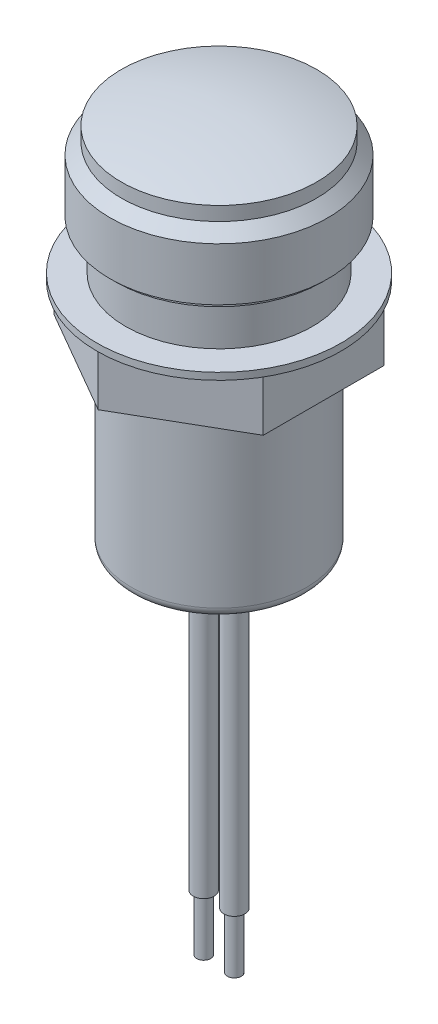
ISO-10303-21;
HEADER;
FILE_DESCRIPTION(('STEP AP214'),'2;1');
FILE_NAME('part.step','',(''),(''),'','','');
FILE_SCHEMA(('AUTOMOTIVE_DESIGN { 1 0 10303 214 1 1 1 1 }'));
ENDSEC;
DATA;
#1=APPLICATION_CONTEXT('core data for automotive mechanical design processes');
#2=APPLICATION_PROTOCOL_DEFINITION('international standard','automotive_design',2000,#1);
#3=PRODUCT_CONTEXT('',#1,'mechanical');
#4=PRODUCT('Part','Part','',(#3));
#5=PRODUCT_RELATED_PRODUCT_CATEGORY('part','',(#4));
#6=PRODUCT_DEFINITION_FORMATION('','',#4);
#7=PRODUCT_DEFINITION_CONTEXT('part definition',#1,'design');
#8=PRODUCT_DEFINITION('design','',#6,#7);
#9=PRODUCT_DEFINITION_SHAPE('','',#8);
#10=(LENGTH_UNIT() NAMED_UNIT(*) SI_UNIT(.MILLI.,.METRE.));
#11=(NAMED_UNIT(*) PLANE_ANGLE_UNIT() SI_UNIT($,.RADIAN.));
#12=(NAMED_UNIT(*) SI_UNIT($,.STERADIAN.) SOLID_ANGLE_UNIT());
#13=UNCERTAINTY_MEASURE_WITH_UNIT(LENGTH_MEASURE(1.E-05),#10,'distance_accuracy_value','');
#14=(GEOMETRIC_REPRESENTATION_CONTEXT(3) GLOBAL_UNCERTAINTY_ASSIGNED_CONTEXT((#13)) GLOBAL_UNIT_ASSIGNED_CONTEXT((#10,
#11,#12)) REPRESENTATION_CONTEXT('',''));
#15=CARTESIAN_POINT('',(0.,0.,0.));
#16=DIRECTION('',(0.,0.,1.));
#17=DIRECTION('',(1.,0.,0.));
#18=AXIS2_PLACEMENT_3D('',#15,#16,#17);
#19=CARTESIAN_POINT('',(0.,5.08000000000001,0.));
#20=DIRECTION('',(0.,0.,1.));
#21=DIRECTION('',(1.,0.,0.));
#22=AXIS2_PLACEMENT_3D('',#19,#20,#21);
#23=SPHERICAL_SURFACE('',#22,31.75);
#24=CARTESIAN_POINT('',(0.,5.08000000000001,0.));
#25=DIRECTION('',(0.,-1.,0.));
#26=DIRECTION('',(0.,0.,-1.));
#27=AXIS2_PLACEMENT_3D('',#24,#25,#26);
#28=SPHERICAL_SURFACE('',#27,31.75);
#29=CARTESIAN_POINT('',(0.,35.56,0.));
#30=DIRECTION('',(0.,-1.,0.));
#31=DIRECTION('',(0.,0.,-1.));
#32=AXIS2_PLACEMENT_3D('',#29,#30,#31);
#33=CIRCLE('',#32,8.89);
#34=CARTESIAN_POINT('',(0.,35.56,-8.89));
#35=VERTEX_POINT('',#34);
#36=EDGE_CURVE('E195',#35,#35,#33,.T.);
#37=ORIENTED_EDGE('',*,*,#36,.F.);
#38=EDGE_LOOP('',(#37));
#39=FACE_BOUND('',#38,.T.);
#40=ADVANCED_FACE('F46',(#39),#28,.T.);
#41=CARTESIAN_POINT('',(0.,0.,0.));
#42=DIRECTION('',(0.,-1.,0.));
#43=DIRECTION('',(0.,0.,-1.));
#44=AXIS2_PLACEMENT_3D('',#41,#42,#43);
#45=CYLINDRICAL_SURFACE('',#44,8.89);
#46=ORIENTED_EDGE('',*,*,#36,.T.);
#47=EDGE_LOOP('',(#46));
#48=FACE_BOUND('',#47,.T.);
#49=CARTESIAN_POINT('',(0.,34.29,0.));
#50=DIRECTION('',(0.,-1.,0.));
#51=DIRECTION('',(0.,0.,-1.));
#52=AXIS2_PLACEMENT_3D('',#49,#50,#51);
#53=CIRCLE('',#52,8.89);
#54=CARTESIAN_POINT('',(0.,34.29,-8.89));
#55=VERTEX_POINT('',#54);
#56=EDGE_CURVE('E191',#55,#55,#53,.T.);
#57=ORIENTED_EDGE('',*,*,#56,.F.);
#58=EDGE_LOOP('',(#57));
#59=FACE_BOUND('',#58,.T.);
#60=ADVANCED_FACE('F313',(#48,#59),#45,.T.);
#61=CARTESIAN_POINT('',(0.,33.2613,0.));
#62=DIRECTION('',(0.,-1.,0.));
#63=DIRECTION('',(0.,0.,-1.));
#64=AXIS2_PLACEMENT_3D('',#61,#62,#63);
#65=CONICAL_SURFACE('',#64,9.9187,0.785398163397449);
#66=ORIENTED_EDGE('',*,*,#56,.T.);
#67=EDGE_LOOP('',(#66));
#68=FACE_BOUND('',#67,.T.);
#69=CARTESIAN_POINT('',(0.,33.2613,0.));
#70=DIRECTION('',(0.,-1.,0.));
#71=DIRECTION('',(0.,0.,-1.));
#72=AXIS2_PLACEMENT_3D('',#69,#70,#71);
#73=CIRCLE('',#72,9.9187);
#74=CARTESIAN_POINT('',(0.,33.2613,-9.9187));
#75=VERTEX_POINT('',#74);
#76=EDGE_CURVE('E187',#75,#75,#73,.T.);
#77=ORIENTED_EDGE('',*,*,#76,.F.);
#78=EDGE_LOOP('',(#77));
#79=FACE_BOUND('',#78,.T.);
#80=ADVANCED_FACE('F319',(#68,#79),#65,.T.);
#81=CARTESIAN_POINT('',(0.,0.,0.));
#82=DIRECTION('',(0.,-1.,0.));
#83=DIRECTION('',(0.,0.,-1.));
#84=AXIS2_PLACEMENT_3D('',#81,#82,#83);
#85=CYLINDRICAL_SURFACE('',#84,9.9187);
#86=ORIENTED_EDGE('',*,*,#76,.T.);
#87=EDGE_LOOP('',(#86));
#88=FACE_BOUND('',#87,.T.);
#89=CARTESIAN_POINT('',(0.,28.448,0.));
#90=DIRECTION('',(0.,-1.,0.));
#91=DIRECTION('',(0.,0.,-1.));
#92=AXIS2_PLACEMENT_3D('',#89,#90,#91);
#93=CIRCLE('',#92,9.9187);
#94=CARTESIAN_POINT('',(0.,28.448,-9.9187));
#95=VERTEX_POINT('',#94);
#96=EDGE_CURVE('E183',#95,#95,#93,.T.);
#97=ORIENTED_EDGE('',*,*,#96,.F.);
#98=EDGE_LOOP('',(#97));
#99=FACE_BOUND('',#98,.T.);
#100=ADVANCED_FACE('F370',(#88,#99),#85,.T.);
#101=CARTESIAN_POINT('',(9.9187,28.448,0.));
#102=DIRECTION('',(0.,-1.,0.));
#103=DIRECTION('',(0.,0.,-1.));
#104=AXIS2_PLACEMENT_3D('',#101,#102,#103);
#105=PLANE('',#104);
#106=ORIENTED_EDGE('',*,*,#96,.T.);
#107=EDGE_LOOP('',(#106));
#108=FACE_BOUND('',#107,.T.);
#109=CARTESIAN_POINT('',(0.,28.448,0.));
#110=DIRECTION('',(0.,-1.,0.));
#111=DIRECTION('',(0.,0.,-1.));
#112=AXIS2_PLACEMENT_3D('',#109,#110,#111);
#113=CIRCLE('',#112,9.40434999999999);
#114=CARTESIAN_POINT('',(0.,28.448,-9.40434999999999));
#115=VERTEX_POINT('',#114);
#116=EDGE_CURVE('E179',#115,#115,#113,.T.);
#117=ORIENTED_EDGE('',*,*,#116,.F.);
#118=EDGE_LOOP('',(#117));
#119=FACE_BOUND('',#118,.T.);
#120=ADVANCED_FACE('F366',(#108,#119),#105,.T.);
#121=CARTESIAN_POINT('',(0.,0.,0.));
#122=DIRECTION('',(0.,-1.,0.));
#123=DIRECTION('',(0.,0.,-1.));
#124=AXIS2_PLACEMENT_3D('',#121,#122,#123);
#125=CYLINDRICAL_SURFACE('',#124,9.40435);
#126=ORIENTED_EDGE('',*,*,#116,.T.);
#127=EDGE_LOOP('',(#126));
#128=FACE_BOUND('',#127,.T.);
#129=CARTESIAN_POINT('',(0.,27.94,0.));
#130=DIRECTION('',(0.,-1.,0.));
#131=DIRECTION('',(0.,0.,-1.));
#132=AXIS2_PLACEMENT_3D('',#129,#130,#131);
#133=CIRCLE('',#132,9.40435);
#134=CARTESIAN_POINT('',(0.,27.94,-9.40435));
#135=VERTEX_POINT('',#134);
#136=EDGE_CURVE('E175',#135,#135,#133,.T.);
#137=ORIENTED_EDGE('',*,*,#136,.F.);
#138=EDGE_LOOP('',(#137));
#139=FACE_BOUND('',#138,.T.);
#140=ADVANCED_FACE('F362',(#128,#139),#125,.T.);
#141=CARTESIAN_POINT('',(9.40435,27.94,0.));
#142=DIRECTION('',(0.,-1.,0.));
#143=DIRECTION('',(0.,0.,-1.));
#144=AXIS2_PLACEMENT_3D('',#141,#142,#143);
#145=PLANE('',#144);
#146=ORIENTED_EDGE('',*,*,#136,.T.);
#147=EDGE_LOOP('',(#146));
#148=FACE_BOUND('',#147,.T.);
#149=CARTESIAN_POINT('',(0.,27.94,0.));
#150=DIRECTION('',(0.,-1.,0.));
#151=DIRECTION('',(0.,0.,-1.));
#152=AXIS2_PLACEMENT_3D('',#149,#150,#151);
#153=CIRCLE('',#152,8.5);
#154=CARTESIAN_POINT('',(0.,27.94,-8.5));
#155=VERTEX_POINT('',#154);
#156=EDGE_CURVE('E171',#155,#155,#153,.T.);
#157=ORIENTED_EDGE('',*,*,#156,.F.);
#158=EDGE_LOOP('',(#157));
#159=FACE_BOUND('',#158,.T.);
#160=ADVANCED_FACE('F358',(#148,#159),#145,.T.);
#161=CARTESIAN_POINT('',(0.,0.,0.));
#162=DIRECTION('',(0.,-1.,0.));
#163=DIRECTION('',(0.,0.,-1.));
#164=AXIS2_PLACEMENT_3D('',#161,#162,#163);
#165=CYLINDRICAL_SURFACE('',#164,8.5);
#166=ORIENTED_EDGE('',*,*,#156,.T.);
#167=EDGE_LOOP('',(#166));
#168=FACE_BOUND('',#167,.T.);
#169=CARTESIAN_POINT('',(0.,23.9776,0.));
#170=DIRECTION('',(0.,-1.,0.));
#171=DIRECTION('',(0.,0.,-1.));
#172=AXIS2_PLACEMENT_3D('',#169,#170,#171);
#173=CIRCLE('',#172,8.5);
#174=CARTESIAN_POINT('',(0.,23.9776,-8.5));
#175=VERTEX_POINT('',#174);
#176=EDGE_CURVE('E167',#175,#175,#173,.T.);
#177=ORIENTED_EDGE('',*,*,#176,.F.);
#178=EDGE_LOOP('',(#177));
#179=FACE_BOUND('',#178,.T.);
#180=ADVANCED_FACE('F354',(#168,#179),#165,.T.);
#181=CARTESIAN_POINT('',(8.5,23.9776,0.));
#182=DIRECTION('',(0.,1.,0.));
#183=DIRECTION('',(0.,0.,1.));
#184=AXIS2_PLACEMENT_3D('',#181,#182,#183);
#185=PLANE('',#184);
#186=ORIENTED_EDGE('',*,*,#176,.T.);
#187=EDGE_LOOP('',(#186));
#188=FACE_BOUND('',#187,.T.);
#189=CARTESIAN_POINT('',(0.,23.9776,0.));
#190=DIRECTION('',(0.,-1.,0.));
#191=DIRECTION('',(0.,0.,-1.));
#192=AXIS2_PLACEMENT_3D('',#189,#190,#191);
#193=CIRCLE('',#192,11.1125);
#194=CARTESIAN_POINT('',(0.,23.9776,-11.1125));
#195=VERTEX_POINT('',#194);
#196=EDGE_CURVE('E163',#195,#195,#193,.T.);
#197=ORIENTED_EDGE('',*,*,#196,.F.);
#198=EDGE_LOOP('',(#197));
#199=FACE_BOUND('',#198,.T.);
#200=ADVANCED_FACE('F350',(#188,#199),#185,.T.);
#201=CARTESIAN_POINT('',(0.,0.,0.));
#202=DIRECTION('',(0.,-1.,0.));
#203=DIRECTION('',(0.,0.,-1.));
#204=AXIS2_PLACEMENT_3D('',#201,#202,#203);
#205=CYLINDRICAL_SURFACE('',#204,11.1125);
#206=CARTESIAN_POINT('',(0.,23.3426,0.));
#207=DIRECTION('',(0.,1.,0.));
#208=DIRECTION('',(0.,0.,1.));
#209=AXIS2_PLACEMENT_3D('',#206,#207,#208);
#210=CIRCLE('',#209,11.1125);
#211=CARTESIAN_POINT('',(0.,23.3426,11.1125));
#212=VERTEX_POINT('',#211);
#213=EDGE_CURVE('E139',#212,#212,#210,.F.);
#214=ORIENTED_EDGE('',*,*,#213,.F.);
#215=EDGE_LOOP('',(#214));
#216=FACE_BOUND('',#215,.T.);
#217=ORIENTED_EDGE('',*,*,#196,.T.);
#218=EDGE_LOOP('',(#217));
#219=FACE_BOUND('',#218,.T.);
#220=ADVANCED_FACE('F347',(#216,#219),#205,.T.);
#221=CARTESIAN_POINT('',(9.525,55.7228053879794,5.49926131403119));
#222=DIRECTION('',(0.5,0.,0.866025403784439));
#223=DIRECTION('',(0.866025403784439,0.,-0.5));
#224=AXIS2_PLACEMENT_3D('',#221,#222,#223);
#225=PLANE('',#224);
#226=DIRECTION('',(-0.866025403784439,0.,0.5));
#227=VECTOR('',#226,1.);
#228=CARTESIAN_POINT('',(9.525,23.3426,5.49926131403119));
#229=LINE('',#228,#227);
#230=CARTESIAN_POINT('',(9.525,23.3426,5.49926131403119));
#231=VERTEX_POINT('',#230);
#232=CARTESIAN_POINT('',(0.,23.3426,10.9985226280624));
#233=VERTEX_POINT('',#232);
#234=EDGE_CURVE('E116',#231,#233,#229,.T.);
#235=ORIENTED_EDGE('',*,*,#234,.T.);
#236=DIRECTION('',(0.,-1.,0.));
#237=VECTOR('',#236,1.);
#238=CARTESIAN_POINT('',(0.,55.7228053879794,10.9985226280624));
#239=LINE('',#238,#237);
#240=CARTESIAN_POINT('',(0.,18.669,10.9985226280624));
#241=VERTEX_POINT('',#240);
#242=EDGE_CURVE('E103',#233,#241,#239,.T.);
#243=ORIENTED_EDGE('',*,*,#242,.T.);
#244=DIRECTION('',(-0.866025403784439,0.,0.5));
#245=VECTOR('',#244,1.);
#246=CARTESIAN_POINT('',(9.525,18.669,5.49926131403119));
#247=LINE('',#246,#245);
#248=CARTESIAN_POINT('',(9.525,18.669,5.49926131403119));
#249=VERTEX_POINT('',#248);
#250=EDGE_CURVE('E132',#249,#241,#247,.T.);
#251=ORIENTED_EDGE('',*,*,#250,.F.);
#252=DIRECTION('',(0.,-1.,0.));
#253=VECTOR('',#252,1.);
#254=CARTESIAN_POINT('',(9.525,55.7228053879794,5.49926131403119));
#255=LINE('',#254,#253);
#256=EDGE_CURVE('E122',#231,#249,#255,.T.);
#257=ORIENTED_EDGE('',*,*,#256,.F.);
#258=EDGE_LOOP('',(#235,#243,#251,#257));
#259=FACE_BOUND('',#258,.T.);
#260=ADVANCED_FACE('F121',(#259),#225,.T.);
#261=CARTESIAN_POINT('',(9.525,55.7228053879794,-5.49926131403119));
#262=DIRECTION('',(1.,0.,0.));
#263=DIRECTION('',(0.,0.,-1.));
#264=AXIS2_PLACEMENT_3D('',#261,#262,#263);
#265=PLANE('',#264);
#266=DIRECTION('',(0.,0.,1.));
#267=VECTOR('',#266,1.);
#268=CARTESIAN_POINT('',(9.525,23.3426,-5.49926131403119));
#269=LINE('',#268,#267);
#270=CARTESIAN_POINT('',(9.525,23.3426,-5.49926131403119));
#271=VERTEX_POINT('',#270);
#272=EDGE_CURVE('E125',#271,#231,#269,.T.);
#273=ORIENTED_EDGE('',*,*,#272,.T.);
#274=ORIENTED_EDGE('',*,*,#256,.T.);
#275=DIRECTION('',(0.,0.,1.));
#276=VECTOR('',#275,1.);
#277=CARTESIAN_POINT('',(9.525,18.669,-5.49926131403119));
#278=LINE('',#277,#276);
#279=CARTESIAN_POINT('',(9.525,18.669,-5.49926131403119));
#280=VERTEX_POINT('',#279);
#281=EDGE_CURVE('E150',#280,#249,#278,.T.);
#282=ORIENTED_EDGE('',*,*,#281,.F.);
#283=DIRECTION('',(0.,-1.,0.));
#284=VECTOR('',#283,1.);
#285=CARTESIAN_POINT('',(9.525,55.7228053879794,-5.49926131403119));
#286=LINE('',#285,#284);
#287=EDGE_CURVE('E147',#271,#280,#286,.T.);
#288=ORIENTED_EDGE('',*,*,#287,.F.);
#289=EDGE_LOOP('',(#273,#274,#282,#288));
#290=FACE_BOUND('',#289,.T.);
#291=ADVANCED_FACE('F432',(#290),#265,.T.);
#292=CARTESIAN_POINT('',(0.,55.7228053879794,-10.9985226280624));
#293=DIRECTION('',(0.5,0.,-0.866025403784439));
#294=DIRECTION('',(-0.866025403784439,0.,-0.5));
#295=AXIS2_PLACEMENT_3D('',#292,#293,#294);
#296=PLANE('',#295);
#297=DIRECTION('',(0.866025403784439,0.,0.5));
#298=VECTOR('',#297,1.);
#299=CARTESIAN_POINT('',(0.,23.3426,-10.9985226280624));
#300=LINE('',#299,#298);
#301=CARTESIAN_POINT('',(0.,23.3426,-10.9985226280624));
#302=VERTEX_POINT('',#301);
#303=EDGE_CURVE('E135',#302,#271,#300,.T.);
#304=ORIENTED_EDGE('',*,*,#303,.T.);
#305=ORIENTED_EDGE('',*,*,#287,.T.);
#306=DIRECTION('',(0.866025403784439,0.,0.5));
#307=VECTOR('',#306,1.);
#308=CARTESIAN_POINT('',(0.,18.669,-10.9985226280624));
#309=LINE('',#308,#307);
#310=CARTESIAN_POINT('',(0.,18.669,-10.9985226280624));
#311=VERTEX_POINT('',#310);
#312=EDGE_CURVE('E153',#311,#280,#309,.T.);
#313=ORIENTED_EDGE('',*,*,#312,.F.);
#314=DIRECTION('',(0.,-1.,0.));
#315=VECTOR('',#314,1.);
#316=CARTESIAN_POINT('',(0.,55.7228053879794,-10.9985226280624));
#317=LINE('',#316,#315);
#318=EDGE_CURVE('E151',#302,#311,#317,.T.);
#319=ORIENTED_EDGE('',*,*,#318,.F.);
#320=EDGE_LOOP('',(#304,#305,#313,#319));
#321=FACE_BOUND('',#320,.T.);
#322=ADVANCED_FACE('F439',(#321),#296,.T.);
#323=CARTESIAN_POINT('',(-9.525,55.7228053879794,-5.49926131403118));
#324=DIRECTION('',(-0.5,0.,-0.866025403784438));
#325=DIRECTION('',(-0.866025403784439,0.,0.5));
#326=AXIS2_PLACEMENT_3D('',#323,#324,#325);
#327=PLANE('',#326);
#328=DIRECTION('',(0.866025403784439,0.,-0.5));
#329=VECTOR('',#328,1.);
#330=CARTESIAN_POINT('',(-9.525,23.3426,-5.49926131403118));
#331=LINE('',#330,#329);
#332=CARTESIAN_POINT('',(-9.525,23.3426,-5.49926131403118));
#333=VERTEX_POINT('',#332);
#334=EDGE_CURVE('E140',#333,#302,#331,.T.);
#335=ORIENTED_EDGE('',*,*,#334,.T.);
#336=ORIENTED_EDGE('',*,*,#318,.T.);
#337=DIRECTION('',(0.866025403784439,0.,-0.5));
#338=VECTOR('',#337,1.);
#339=CARTESIAN_POINT('',(-9.525,18.669,-5.49926131403118));
#340=LINE('',#339,#338);
#341=CARTESIAN_POINT('',(-9.525,18.669,-5.49926131403118));
#342=VERTEX_POINT('',#341);
#343=EDGE_CURVE('E156',#342,#311,#340,.T.);
#344=ORIENTED_EDGE('',*,*,#343,.F.);
#345=DIRECTION('',(0.,-1.,0.));
#346=VECTOR('',#345,1.);
#347=CARTESIAN_POINT('',(-9.525,55.7228053879794,-5.49926131403118));
#348=LINE('',#347,#346);
#349=EDGE_CURVE('E154',#333,#342,#348,.T.);
#350=ORIENTED_EDGE('',*,*,#349,.F.);
#351=EDGE_LOOP('',(#335,#336,#344,#350));
#352=FACE_BOUND('',#351,.T.);
#353=ADVANCED_FACE('F447',(#352),#327,.T.);
#354=CARTESIAN_POINT('',(-9.525,55.7228053879794,5.49926131403119));
#355=DIRECTION('',(-1.,0.,0.));
#356=DIRECTION('',(0.,0.,1.));
#357=AXIS2_PLACEMENT_3D('',#354,#355,#356);
#358=PLANE('',#357);
#359=DIRECTION('',(0.,0.,-1.));
#360=VECTOR('',#359,1.);
#361=CARTESIAN_POINT('',(-9.525,23.3426,5.49926131403119));
#362=LINE('',#361,#360);
#363=CARTESIAN_POINT('',(-9.525,23.3426,5.49926131403119));
#364=VERTEX_POINT('',#363);
#365=EDGE_CURVE('E118',#364,#333,#362,.T.);
#366=ORIENTED_EDGE('',*,*,#365,.T.);
#367=ORIENTED_EDGE('',*,*,#349,.T.);
#368=DIRECTION('',(0.,0.,-1.));
#369=VECTOR('',#368,1.);
#370=CARTESIAN_POINT('',(-9.525,18.669,5.49926131403119));
#371=LINE('',#370,#369);
#372=CARTESIAN_POINT('',(-9.525,18.669,5.49926131403119));
#373=VERTEX_POINT('',#372);
#374=EDGE_CURVE('E65',#373,#342,#371,.T.);
#375=ORIENTED_EDGE('',*,*,#374,.F.);
#376=DIRECTION('',(0.,-1.,0.));
#377=VECTOR('',#376,1.);
#378=CARTESIAN_POINT('',(-9.525,55.7228053879794,5.49926131403119));
#379=LINE('',#378,#377);
#380=EDGE_CURVE('E69',#364,#373,#379,.T.);
#381=ORIENTED_EDGE('',*,*,#380,.F.);
#382=EDGE_LOOP('',(#366,#367,#375,#381));
#383=FACE_BOUND('',#382,.T.);
#384=ADVANCED_FACE('F455',(#383),#358,.T.);
#385=CARTESIAN_POINT('',(0.,55.7228053879794,10.9985226280624));
#386=DIRECTION('',(-0.5,0.,0.866025403784439));
#387=DIRECTION('',(0.866025403784439,0.,0.5));
#388=AXIS2_PLACEMENT_3D('',#385,#386,#387);
#389=PLANE('',#388);
#390=DIRECTION('',(-0.866025403784439,0.,-0.5));
#391=VECTOR('',#390,1.);
#392=CARTESIAN_POINT('',(0.,23.3426,10.9985226280624));
#393=LINE('',#392,#391);
#394=EDGE_CURVE('E106',#233,#364,#393,.T.);
#395=ORIENTED_EDGE('',*,*,#394,.T.);
#396=ORIENTED_EDGE('',*,*,#380,.T.);
#397=DIRECTION('',(-0.866025403784439,0.,-0.5));
#398=VECTOR('',#397,1.);
#399=CARTESIAN_POINT('',(0.,18.669,10.9985226280624));
#400=LINE('',#399,#398);
#401=EDGE_CURVE('E108',#241,#373,#400,.T.);
#402=ORIENTED_EDGE('',*,*,#401,.F.);
#403=ORIENTED_EDGE('',*,*,#242,.F.);
#404=EDGE_LOOP('',(#395,#396,#402,#403));
#405=FACE_BOUND('',#404,.T.);
#406=ADVANCED_FACE('F105',(#405),#389,.T.);
#407=CARTESIAN_POINT('',(8.5,23.3426,0.));
#408=DIRECTION('',(0.,1.,0.));
#409=DIRECTION('',(0.,0.,1.));
#410=AXIS2_PLACEMENT_3D('',#407,#408,#409);
#411=PLANE('',#410);
#412=ORIENTED_EDGE('',*,*,#213,.T.);
#413=EDGE_LOOP('',(#412));
#414=FACE_BOUND('',#413,.T.);
#415=ORIENTED_EDGE('',*,*,#272,.F.);
#416=ORIENTED_EDGE('',*,*,#303,.F.);
#417=ORIENTED_EDGE('',*,*,#334,.F.);
#418=ORIENTED_EDGE('',*,*,#365,.F.);
#419=ORIENTED_EDGE('',*,*,#394,.F.);
#420=ORIENTED_EDGE('',*,*,#234,.F.);
#421=EDGE_LOOP('',(#415,#416,#417,#418,#419,#420));
#422=FACE_BOUND('',#421,.T.);
#423=ADVANCED_FACE('F115',(#414,#422),#411,.F.);
#424=CARTESIAN_POINT('',(3.81,0.,0.));
#425=DIRECTION('',(0.,-1.,0.));
#426=DIRECTION('',(0.,0.,-1.));
#427=AXIS2_PLACEMENT_3D('',#424,#425,#426);
#428=PLANE('',#427);
#429=CARTESIAN_POINT('',(0.,0.,0.));
#430=DIRECTION('',(0.,-1.,0.));
#431=DIRECTION('',(0.,0.,-1.));
#432=AXIS2_PLACEMENT_3D('',#429,#430,#431);
#433=CIRCLE('',#432,3.429);
#434=CARTESIAN_POINT('',(0.,0.,-3.429));
#435=VERTEX_POINT('',#434);
#436=EDGE_CURVE('E212',#435,#435,#433,.T.);
#437=ORIENTED_EDGE('',*,*,#436,.T.);
#438=EDGE_LOOP('',(#437));
#439=FACE_BOUND('',#438,.T.);
#440=CARTESIAN_POINT('',(1.397,0.,0.));
#441=DIRECTION('',(0.,-1.,0.));
#442=DIRECTION('',(0.,0.,-1.));
#443=AXIS2_PLACEMENT_3D('',#440,#441,#442);
#444=CIRCLE('',#443,0.9525);
#445=CARTESIAN_POINT('',(1.397,0.,-0.952499999999999));
#446=VERTEX_POINT('',#445);
#447=EDGE_CURVE('E241',#446,#446,#444,.T.);
#448=ORIENTED_EDGE('',*,*,#447,.F.);
#449=EDGE_LOOP('',(#448));
#450=FACE_BOUND('',#449,.T.);
#451=CARTESIAN_POINT('',(-1.397,0.,0.));
#452=DIRECTION('',(0.,-1.,0.));
#453=DIRECTION('',(0.,0.,-1.));
#454=AXIS2_PLACEMENT_3D('',#451,#452,#453);
#455=CIRCLE('',#454,0.9525);
#456=CARTESIAN_POINT('',(-1.397,0.,-0.9525));
#457=VERTEX_POINT('',#456);
#458=EDGE_CURVE('E244',#457,#457,#455,.T.);
#459=ORIENTED_EDGE('',*,*,#458,.F.);
#460=EDGE_LOOP('',(#459));
#461=FACE_BOUND('',#460,.T.);
#462=ADVANCED_FACE('F234',(#439,#450,#461),#428,.T.);
#463=CARTESIAN_POINT('',(0.,0.,0.));
#464=DIRECTION('',(0.,-1.,0.));
#465=DIRECTION('',(0.,0.,-1.));
#466=AXIS2_PLACEMENT_3D('',#463,#464,#465);
#467=CYLINDRICAL_SURFACE('',#466,3.81);
#468=CARTESIAN_POINT('',(0.,0.381,0.));
#469=DIRECTION('',(0.,-1.,0.));
#470=DIRECTION('',(0.,0.,-1.));
#471=AXIS2_PLACEMENT_3D('',#468,#469,#470);
#472=CIRCLE('',#471,3.81);
#473=CARTESIAN_POINT('',(0.,0.381,-3.81));
#474=VERTEX_POINT('',#473);
#475=EDGE_CURVE('E55',#474,#474,#472,.F.);
#476=ORIENTED_EDGE('',*,*,#475,.T.);
#477=EDGE_LOOP('',(#476));
#478=FACE_BOUND('',#477,.T.);
#479=CARTESIAN_POINT('',(0.,1.905,0.));
#480=DIRECTION('',(0.,-1.,0.));
#481=DIRECTION('',(0.,0.,-1.));
#482=AXIS2_PLACEMENT_3D('',#479,#480,#481);
#483=CIRCLE('',#482,3.81);
#484=CARTESIAN_POINT('',(0.,1.905,-3.81));
#485=VERTEX_POINT('',#484);
#486=EDGE_CURVE('E216',#485,#485,#483,.T.);
#487=ORIENTED_EDGE('',*,*,#486,.T.);
#488=EDGE_LOOP('',(#487));
#489=FACE_BOUND('',#488,.T.);
#490=ADVANCED_FACE('F225',(#478,#489),#467,.T.);
#491=CARTESIAN_POINT('',(7.992,2.286,0.));
#492=DIRECTION('',(0.,-1.,0.));
#493=DIRECTION('',(0.,0.,-1.));
#494=AXIS2_PLACEMENT_3D('',#491,#492,#493);
#495=PLANE('',#494);
#496=CARTESIAN_POINT('',(0.,2.286,0.));
#497=DIRECTION('',(0.,-1.,0.));
#498=DIRECTION('',(0.,0.,-1.));
#499=AXIS2_PLACEMENT_3D('',#496,#497,#498);
#500=CIRCLE('',#499,4.191);
#501=CARTESIAN_POINT('',(0.,2.286,-4.191));
#502=VERTEX_POINT('',#501);
#503=EDGE_CURVE('E13',#502,#502,#500,.F.);
#504=ORIENTED_EDGE('',*,*,#503,.T.);
#505=EDGE_LOOP('',(#504));
#506=FACE_BOUND('',#505,.T.);
#507=CARTESIAN_POINT('',(0.,2.286,0.));
#508=DIRECTION('',(0.,-1.,0.));
#509=DIRECTION('',(0.,0.,-1.));
#510=AXIS2_PLACEMENT_3D('',#507,#508,#509);
#511=CIRCLE('',#510,7.103);
#512=CARTESIAN_POINT('',(0.,2.286,-7.103));
#513=VERTEX_POINT('',#512);
#514=EDGE_CURVE('E203',#513,#513,#511,.T.);
#515=ORIENTED_EDGE('',*,*,#514,.T.);
#516=EDGE_LOOP('',(#515));
#517=FACE_BOUND('',#516,.T.);
#518=ADVANCED_FACE('F334',(#506,#517),#495,.T.);
#519=CARTESIAN_POINT('',(0.,0.,0.));
#520=DIRECTION('',(0.,-1.,0.));
#521=DIRECTION('',(0.,0.,-1.));
#522=AXIS2_PLACEMENT_3D('',#519,#520,#521);
#523=CYLINDRICAL_SURFACE('',#522,7.992);
#524=CARTESIAN_POINT('',(0.,3.175,0.));
#525=DIRECTION('',(0.,-1.,0.));
#526=DIRECTION('',(0.,0.,-1.));
#527=AXIS2_PLACEMENT_3D('',#524,#525,#526);
#528=CIRCLE('',#527,7.992);
#529=CARTESIAN_POINT('',(0.,3.175,-7.992));
#530=VERTEX_POINT('',#529);
#531=EDGE_CURVE('E207',#530,#530,#528,.F.);
#532=ORIENTED_EDGE('',*,*,#531,.T.);
#533=EDGE_LOOP('',(#532));
#534=FACE_BOUND('',#533,.T.);
#535=CARTESIAN_POINT('',(0.,18.669,0.));
#536=DIRECTION('',(0.,-1.,0.));
#537=DIRECTION('',(0.,0.,-1.));
#538=AXIS2_PLACEMENT_3D('',#535,#536,#537);
#539=CIRCLE('',#538,7.992);
#540=CARTESIAN_POINT('',(0.,18.669,-7.992));
#541=VERTEX_POINT('',#540);
#542=EDGE_CURVE('E159',#541,#541,#539,.T.);
#543=ORIENTED_EDGE('',*,*,#542,.T.);
#544=EDGE_LOOP('',(#543));
#545=FACE_BOUND('',#544,.T.);
#546=ADVANCED_FACE('F308',(#534,#545),#523,.T.);
#547=CARTESIAN_POINT('',(11.1125,18.669,0.));
#548=DIRECTION('',(0.,-1.,0.));
#549=DIRECTION('',(0.,0.,-1.));
#550=AXIS2_PLACEMENT_3D('',#547,#548,#549);
#551=PLANE('',#550);
#552=ORIENTED_EDGE('',*,*,#542,.F.);
#553=EDGE_LOOP('',(#552));
#554=FACE_BOUND('',#553,.T.);
#555=ORIENTED_EDGE('',*,*,#281,.T.);
#556=ORIENTED_EDGE('',*,*,#250,.T.);
#557=ORIENTED_EDGE('',*,*,#401,.T.);
#558=ORIENTED_EDGE('',*,*,#374,.T.);
#559=ORIENTED_EDGE('',*,*,#343,.T.);
#560=ORIENTED_EDGE('',*,*,#312,.T.);
#561=EDGE_LOOP('',(#555,#556,#557,#558,#559,#560));
#562=FACE_BOUND('',#561,.T.);
#563=ADVANCED_FACE('F266',(#554,#562),#551,.T.);
#564=CARTESIAN_POINT('',(-1.397,-25.4,0.));
#565=DIRECTION('',(0.,1.,0.));
#566=DIRECTION('',(0.,0.,1.));
#567=AXIS2_PLACEMENT_3D('',#564,#565,#566);
#568=CYLINDRICAL_SURFACE('',#567,0.9525);
#569=CARTESIAN_POINT('',(-1.397,-25.4,0.));
#570=DIRECTION('',(0.,-1.,0.));
#571=DIRECTION('',(0.,0.,-1.));
#572=AXIS2_PLACEMENT_3D('',#569,#570,#571);
#573=CIRCLE('',#572,0.9525);
#574=CARTESIAN_POINT('',(-1.397,-25.4,-0.9525));
#575=VERTEX_POINT('',#574);
#576=EDGE_CURVE('E146',#575,#575,#573,.T.);
#577=ORIENTED_EDGE('',*,*,#576,.F.);
#578=EDGE_LOOP('',(#577));
#579=FACE_BOUND('',#578,.T.);
#580=ORIENTED_EDGE('',*,*,#458,.T.);
#581=EDGE_LOOP('',(#580));
#582=FACE_BOUND('',#581,.T.);
#583=ADVANCED_FACE('F299',(#579,#582),#568,.T.);
#584=CARTESIAN_POINT('',(-1.397,-25.4,0.));
#585=DIRECTION('',(0.,-1.,0.));
#586=DIRECTION('',(0.,0.,-1.));
#587=AXIS2_PLACEMENT_3D('',#584,#585,#586);
#588=PLANE('',#587);
#589=CARTESIAN_POINT('',(-1.397,-25.4,0.));
#590=DIRECTION('',(0.,-1.,0.));
#591=DIRECTION('',(0.,0.,-1.));
#592=AXIS2_PLACEMENT_3D('',#589,#590,#591);
#593=CIRCLE('',#592,0.635);
#594=CARTESIAN_POINT('',(-1.397,-25.4,-0.635));
#595=VERTEX_POINT('',#594);
#596=EDGE_CURVE('E208',#595,#595,#593,.T.);
#597=ORIENTED_EDGE('',*,*,#596,.F.);
#598=EDGE_LOOP('',(#597));
#599=FACE_BOUND('',#598,.T.);
#600=ORIENTED_EDGE('',*,*,#576,.T.);
#601=EDGE_LOOP('',(#600));
#602=FACE_BOUND('',#601,.T.);
#603=ADVANCED_FACE('F295',(#599,#602),#588,.T.);
#604=CARTESIAN_POINT('',(1.397,-25.4,0.));
#605=DIRECTION('',(0.,1.,0.));
#606=DIRECTION('',(0.,0.,1.));
#607=AXIS2_PLACEMENT_3D('',#604,#605,#606);
#608=CYLINDRICAL_SURFACE('',#607,0.9525);
#609=CARTESIAN_POINT('',(1.397,-25.4,0.));
#610=DIRECTION('',(0.,-1.,0.));
#611=DIRECTION('',(0.,0.,-1.));
#612=AXIS2_PLACEMENT_3D('',#609,#610,#611);
#613=CIRCLE('',#612,0.9525);
#614=CARTESIAN_POINT('',(1.397,-25.4,-0.952499999999999));
#615=VERTEX_POINT('',#614);
#616=EDGE_CURVE('E246',#615,#615,#613,.T.);
#617=ORIENTED_EDGE('',*,*,#616,.F.);
#618=EDGE_LOOP('',(#617));
#619=FACE_BOUND('',#618,.T.);
#620=ORIENTED_EDGE('',*,*,#447,.T.);
#621=EDGE_LOOP('',(#620));
#622=FACE_BOUND('',#621,.T.);
#623=ADVANCED_FACE('F298',(#619,#622),#608,.T.);
#624=CARTESIAN_POINT('',(1.397,-25.4,0.));
#625=DIRECTION('',(0.,-1.,0.));
#626=DIRECTION('',(0.,0.,-1.));
#627=AXIS2_PLACEMENT_3D('',#624,#625,#626);
#628=PLANE('',#627);
#629=CARTESIAN_POINT('',(1.397,-25.4,0.));
#630=DIRECTION('',(0.,-1.,0.));
#631=DIRECTION('',(0.,0.,-1.));
#632=AXIS2_PLACEMENT_3D('',#629,#630,#631);
#633=CIRCLE('',#632,0.635);
#634=CARTESIAN_POINT('',(1.397,-25.4,-0.634999999999999));
#635=VERTEX_POINT('',#634);
#636=EDGE_CURVE('E199',#635,#635,#633,.T.);
#637=ORIENTED_EDGE('',*,*,#636,.F.);
#638=EDGE_LOOP('',(#637));
#639=FACE_BOUND('',#638,.T.);
#640=ORIENTED_EDGE('',*,*,#616,.T.);
#641=EDGE_LOOP('',(#640));
#642=FACE_BOUND('',#641,.T.);
#643=ADVANCED_FACE('F538',(#639,#642),#628,.T.);
#644=CARTESIAN_POINT('',(1.397,-30.48,0.));
#645=DIRECTION('',(0.,1.,0.));
#646=DIRECTION('',(0.,0.,1.));
#647=AXIS2_PLACEMENT_3D('',#644,#645,#646);
#648=CYLINDRICAL_SURFACE('',#647,0.635);
#649=CARTESIAN_POINT('',(1.397,-30.48,0.));
#650=DIRECTION('',(0.,-1.,0.));
#651=DIRECTION('',(0.,0.,-1.));
#652=AXIS2_PLACEMENT_3D('',#649,#650,#651);
#653=CIRCLE('',#652,0.635);
#654=CARTESIAN_POINT('',(1.397,-30.48,-0.634999999999999));
#655=VERTEX_POINT('',#654);
#656=EDGE_CURVE('E269',#655,#655,#653,.T.);
#657=ORIENTED_EDGE('',*,*,#656,.F.);
#658=EDGE_LOOP('',(#657));
#659=FACE_BOUND('',#658,.T.);
#660=ORIENTED_EDGE('',*,*,#636,.T.);
#661=EDGE_LOOP('',(#660));
#662=FACE_BOUND('',#661,.T.);
#663=ADVANCED_FACE('F528',(#659,#662),#648,.T.);
#664=CARTESIAN_POINT('',(1.397,-30.48,0.));
#665=DIRECTION('',(0.,-1.,0.));
#666=DIRECTION('',(0.,0.,-1.));
#667=AXIS2_PLACEMENT_3D('',#664,#665,#666);
#668=PLANE('',#667);
#669=ORIENTED_EDGE('',*,*,#656,.T.);
#670=EDGE_LOOP('',(#669));
#671=FACE_BOUND('',#670,.T.);
#672=ADVANCED_FACE('F291',(#671),#668,.T.);
#673=CARTESIAN_POINT('',(-1.397,-30.48,0.));
#674=DIRECTION('',(0.,1.,0.));
#675=DIRECTION('',(0.,0.,1.));
#676=AXIS2_PLACEMENT_3D('',#673,#674,#675);
#677=CYLINDRICAL_SURFACE('',#676,0.635);
#678=CARTESIAN_POINT('',(-1.397,-30.48,0.));
#679=DIRECTION('',(0.,-1.,0.));
#680=DIRECTION('',(0.,0.,-1.));
#681=AXIS2_PLACEMENT_3D('',#678,#679,#680);
#682=CIRCLE('',#681,0.635);
#683=CARTESIAN_POINT('',(-1.397,-30.48,-0.635));
#684=VERTEX_POINT('',#683);
#685=EDGE_CURVE('E273',#684,#684,#682,.T.);
#686=ORIENTED_EDGE('',*,*,#685,.F.);
#687=EDGE_LOOP('',(#686));
#688=FACE_BOUND('',#687,.T.);
#689=ORIENTED_EDGE('',*,*,#596,.T.);
#690=EDGE_LOOP('',(#689));
#691=FACE_BOUND('',#690,.T.);
#692=ADVANCED_FACE('F288',(#688,#691),#677,.T.);
#693=CARTESIAN_POINT('',(-1.397,-30.48,0.));
#694=DIRECTION('',(0.,-1.,0.));
#695=DIRECTION('',(0.,0.,-1.));
#696=AXIS2_PLACEMENT_3D('',#693,#694,#695);
#697=PLANE('',#696);
#698=ORIENTED_EDGE('',*,*,#685,.T.);
#699=EDGE_LOOP('',(#698));
#700=FACE_BOUND('',#699,.T.);
#701=ADVANCED_FACE('F286',(#700),#697,.T.);
#702=CARTESIAN_POINT('',(0.,3.175,0.));
#703=DIRECTION('',(0.,-1.,0.));
#704=DIRECTION('',(0.,0.,-1.));
#705=AXIS2_PLACEMENT_3D('',#702,#703,#704);
#706=TOROIDAL_SURFACE('',#705,7.103,0.889);
#707=ORIENTED_EDGE('',*,*,#531,.F.);
#708=EDGE_LOOP('',(#707));
#709=FACE_BOUND('',#708,.T.);
#710=ORIENTED_EDGE('',*,*,#514,.F.);
#711=EDGE_LOOP('',(#710));
#712=FACE_BOUND('',#711,.T.);
#713=ADVANCED_FACE('F231',(#709,#712),#706,.T.);
#714=CARTESIAN_POINT('',(0.,0.381,0.));
#715=DIRECTION('',(0.,-1.,0.));
#716=DIRECTION('',(0.,0.,-1.));
#717=AXIS2_PLACEMENT_3D('',#714,#715,#716);
#718=TOROIDAL_SURFACE('',#717,3.429,0.381);
#719=ORIENTED_EDGE('',*,*,#475,.F.);
#720=EDGE_LOOP('',(#719));
#721=FACE_BOUND('',#720,.T.);
#722=ORIENTED_EDGE('',*,*,#436,.F.);
#723=EDGE_LOOP('',(#722));
#724=FACE_BOUND('',#723,.T.);
#725=ADVANCED_FACE('F228',(#721,#724),#718,.T.);
#726=CARTESIAN_POINT('',(0.,1.905,0.));
#727=DIRECTION('',(0.,-1.,0.));
#728=DIRECTION('',(0.,0.,-1.));
#729=AXIS2_PLACEMENT_3D('',#726,#727,#728);
#730=TOROIDAL_SURFACE('',#729,4.191,0.381);
#731=ORIENTED_EDGE('',*,*,#503,.F.);
#732=EDGE_LOOP('',(#731));
#733=FACE_BOUND('',#732,.T.);
#734=ORIENTED_EDGE('',*,*,#486,.F.);
#735=EDGE_LOOP('',(#734));
#736=FACE_BOUND('',#735,.T.);
#737=ADVANCED_FACE('F48',(#733,#736),#730,.F.);
#738=CLOSED_SHELL('',(#40,#60,#80,#100,#120,#140,#160,#180,#200,#220,#260,#291,#322,#353,#384,
#406,#423,#462,#490,#518,#546,#563,#583,#603,#623,#643,#663,#672,#692,#701,#713,#725,#737));
#739=MANIFOLD_SOLID_BREP('B2',#738);
#740=ADVANCED_BREP_SHAPE_REPRESENTATION('',(#18,#739),#14);
#741=SHAPE_DEFINITION_REPRESENTATION(#9,#740);
ENDSEC;
END-ISO-10303-21;
